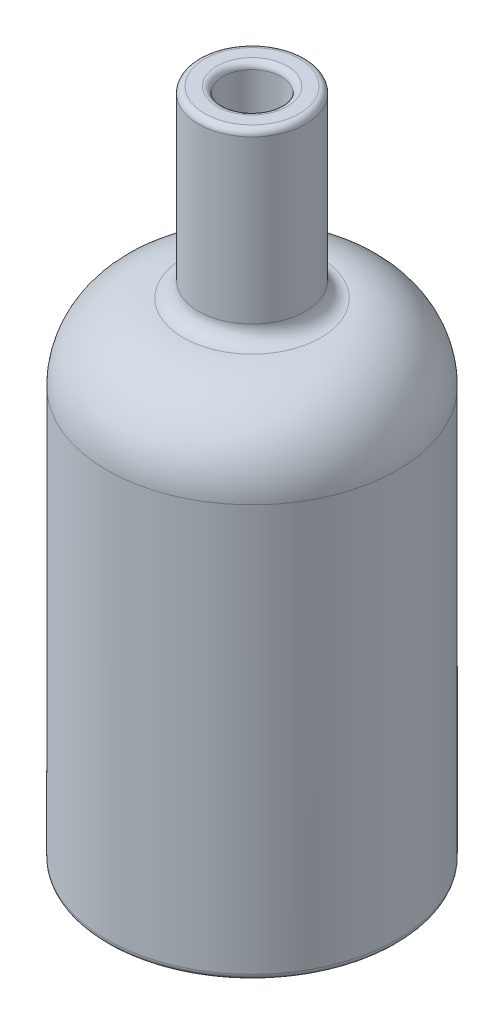
ISO-10303-21;
HEADER;
FILE_DESCRIPTION(('STEP AP214'),'2;1');
FILE_NAME('part.step','',(''),(''),'','','');
FILE_SCHEMA(('AUTOMOTIVE_DESIGN { 1 0 10303 214 1 1 1 1 }'));
ENDSEC;
DATA;
#1=APPLICATION_CONTEXT('core data for automotive mechanical design processes');
#2=APPLICATION_PROTOCOL_DEFINITION('international standard','automotive_design',2000,#1);
#3=PRODUCT_CONTEXT('',#1,'mechanical');
#4=PRODUCT('Part','Part','',(#3));
#5=PRODUCT_RELATED_PRODUCT_CATEGORY('part','',(#4));
#6=PRODUCT_DEFINITION_FORMATION('','',#4);
#7=PRODUCT_DEFINITION_CONTEXT('part definition',#1,'design');
#8=PRODUCT_DEFINITION('design','',#6,#7);
#9=PRODUCT_DEFINITION_SHAPE('','',#8);
#10=(LENGTH_UNIT() NAMED_UNIT(*) SI_UNIT(.MILLI.,.METRE.));
#11=(NAMED_UNIT(*) PLANE_ANGLE_UNIT() SI_UNIT($,.RADIAN.));
#12=(NAMED_UNIT(*) SI_UNIT($,.STERADIAN.) SOLID_ANGLE_UNIT());
#13=UNCERTAINTY_MEASURE_WITH_UNIT(LENGTH_MEASURE(1.E-05),#10,'distance_accuracy_value','');
#14=(GEOMETRIC_REPRESENTATION_CONTEXT(3) GLOBAL_UNCERTAINTY_ASSIGNED_CONTEXT((#13)) GLOBAL_UNIT_ASSIGNED_CONTEXT((#10,
#11,#12)) REPRESENTATION_CONTEXT('',''));
#15=CARTESIAN_POINT('',(0.,0.,0.));
#16=DIRECTION('',(0.,0.,1.));
#17=DIRECTION('',(1.,0.,0.));
#18=AXIS2_PLACEMENT_3D('',#15,#16,#17);
#19=CARTESIAN_POINT('',(0.,0.,0.));
#20=DIRECTION('',(0.,-1.,0.));
#21=DIRECTION('',(0.,0.,-1.));
#22=AXIS2_PLACEMENT_3D('',#19,#20,#21);
#23=PLANE('',#22);
#24=CARTESIAN_POINT('',(0.,0.,0.));
#25=DIRECTION('',(0.,-1.,0.));
#26=DIRECTION('',(0.,0.,-1.));
#27=AXIS2_PLACEMENT_3D('',#24,#25,#26);
#28=CIRCLE('',#27,45.5);
#29=CARTESIAN_POINT('',(0.,0.,-45.5));
#30=VERTEX_POINT('',#29);
#31=EDGE_CURVE('E60',#30,#30,#28,.T.);
#32=ORIENTED_EDGE('',*,*,#31,.T.);
#33=EDGE_LOOP('',(#32));
#34=FACE_BOUND('',#33,.T.);
#35=ADVANCED_FACE('F31',(#34),#23,.T.);
#36=CARTESIAN_POINT('',(0.,0.,0.));
#37=DIRECTION('',(0.,-1.,0.));
#38=DIRECTION('',(0.,0.,-1.));
#39=AXIS2_PLACEMENT_3D('',#36,#37,#38);
#40=CYLINDRICAL_SURFACE('',#39,47.5);
#41=CARTESIAN_POINT('',(0.,2.,0.));
#42=DIRECTION('',(0.,-1.,0.));
#43=DIRECTION('',(0.,0.,-1.));
#44=AXIS2_PLACEMENT_3D('',#41,#42,#43);
#45=CIRCLE('',#44,47.5);
#46=CARTESIAN_POINT('',(0.,2.,-47.5));
#47=VERTEX_POINT('',#46);
#48=EDGE_CURVE('E57',#47,#47,#45,.F.);
#49=ORIENTED_EDGE('',*,*,#48,.T.);
#50=EDGE_LOOP('',(#49));
#51=FACE_BOUND('',#50,.T.);
#52=CARTESIAN_POINT('',(0.,135.,0.));
#53=DIRECTION('',(0.,1.,0.));
#54=DIRECTION('',(0.,0.,1.));
#55=AXIS2_PLACEMENT_3D('',#52,#53,#54);
#56=CIRCLE('',#55,47.5);
#57=CARTESIAN_POINT('',(0.,135.,47.5));
#58=VERTEX_POINT('',#57);
#59=EDGE_CURVE('E75',#58,#58,#56,.F.);
#60=ORIENTED_EDGE('',*,*,#59,.T.);
#61=EDGE_LOOP('',(#60));
#62=FACE_BOUND('',#61,.T.);
#63=ADVANCED_FACE('F100',(#51,#62),#40,.T.);
#64=CARTESIAN_POINT('',(0.,0.,0.));
#65=DIRECTION('',(0.,-1.,0.));
#66=DIRECTION('',(0.,0.,-1.));
#67=AXIS2_PLACEMENT_3D('',#64,#65,#66);
#68=CYLINDRICAL_SURFACE('',#67,17.5);
#69=CARTESIAN_POINT('',(0.,218.,0.));
#70=DIRECTION('',(0.,1.,0.));
#71=DIRECTION('',(0.,0.,1.));
#72=AXIS2_PLACEMENT_3D('',#69,#70,#71);
#73=CIRCLE('',#72,17.5);
#74=CARTESIAN_POINT('',(0.,218.,17.5));
#75=VERTEX_POINT('',#74);
#76=EDGE_CURVE('E66',#75,#75,#73,.F.);
#77=ORIENTED_EDGE('',*,*,#76,.T.);
#78=EDGE_LOOP('',(#77));
#79=FACE_BOUND('',#78,.T.);
#80=CARTESIAN_POINT('',(0.,165.,0.));
#81=DIRECTION('',(0.,1.,0.));
#82=DIRECTION('',(0.,0.,1.));
#83=AXIS2_PLACEMENT_3D('',#80,#81,#82);
#84=CIRCLE('',#83,17.5);
#85=CARTESIAN_POINT('',(0.,165.,17.5));
#86=VERTEX_POINT('',#85);
#87=EDGE_CURVE('E69',#86,#86,#84,.T.);
#88=ORIENTED_EDGE('',*,*,#87,.T.);
#89=EDGE_LOOP('',(#88));
#90=FACE_BOUND('',#89,.T.);
#91=ADVANCED_FACE('F106',(#79,#90),#68,.T.);
#92=CARTESIAN_POINT('',(9.49999999999999,220.,0.));
#93=DIRECTION('',(0.,1.,0.));
#94=DIRECTION('',(0.,0.,1.));
#95=AXIS2_PLACEMENT_3D('',#92,#93,#94);
#96=PLANE('',#95);
#97=CARTESIAN_POINT('',(0.,220.,0.));
#98=DIRECTION('',(0.,1.,0.));
#99=DIRECTION('',(0.,0.,1.));
#100=AXIS2_PLACEMENT_3D('',#97,#98,#99);
#101=CIRCLE('',#100,11.5);
#102=CARTESIAN_POINT('',(0.,220.,11.5));
#103=VERTEX_POINT('',#102);
#104=EDGE_CURVE('E38',#103,#103,#101,.F.);
#105=ORIENTED_EDGE('',*,*,#104,.T.);
#106=EDGE_LOOP('',(#105));
#107=FACE_BOUND('',#106,.T.);
#108=CARTESIAN_POINT('',(0.,220.,0.));
#109=DIRECTION('',(0.,1.,0.));
#110=DIRECTION('',(0.,0.,1.));
#111=AXIS2_PLACEMENT_3D('',#108,#109,#110);
#112=CIRCLE('',#111,15.5);
#113=CARTESIAN_POINT('',(0.,220.,15.5));
#114=VERTEX_POINT('',#113);
#115=EDGE_CURVE('E63',#114,#114,#112,.T.);
#116=ORIENTED_EDGE('',*,*,#115,.T.);
#117=EDGE_LOOP('',(#116));
#118=FACE_BOUND('',#117,.T.);
#119=ADVANCED_FACE('F97',(#107,#118),#96,.T.);
#120=CARTESIAN_POINT('',(0.,0.,0.));
#121=DIRECTION('',(0.,-1.,0.));
#122=DIRECTION('',(0.,0.,-1.));
#123=AXIS2_PLACEMENT_3D('',#120,#121,#122);
#124=CYLINDRICAL_SURFACE('',#123,9.49999999999999);
#125=CARTESIAN_POINT('',(0.,218.,0.));
#126=DIRECTION('',(0.,1.,0.));
#127=DIRECTION('',(0.,0.,1.));
#128=AXIS2_PLACEMENT_3D('',#125,#126,#127);
#129=CIRCLE('',#128,9.49999999999999);
#130=CARTESIAN_POINT('',(0.,218.,9.49999999999999));
#131=VERTEX_POINT('',#130);
#132=EDGE_CURVE('E10',#131,#131,#129,.T.);
#133=ORIENTED_EDGE('',*,*,#132,.T.);
#134=EDGE_LOOP('',(#133));
#135=FACE_BOUND('',#134,.T.);
#136=CARTESIAN_POINT('',(0.,152.,0.));
#137=DIRECTION('',(0.,-1.,0.));
#138=DIRECTION('',(0.,0.,-1.));
#139=AXIS2_PLACEMENT_3D('',#136,#137,#138);
#140=CIRCLE('',#139,9.49999999999999);
#141=CARTESIAN_POINT('',(0.,152.,-9.49999999999999));
#142=VERTEX_POINT('',#141);
#143=EDGE_CURVE('E78',#142,#142,#140,.T.);
#144=ORIENTED_EDGE('',*,*,#143,.T.);
#145=EDGE_LOOP('',(#144));
#146=FACE_BOUND('',#145,.T.);
#147=ADVANCED_FACE('F82',(#135,#146),#124,.F.);
#148=CARTESIAN_POINT('',(39.5,152.,0.));
#149=DIRECTION('',(0.,-1.,0.));
#150=DIRECTION('',(0.,0.,-1.));
#151=AXIS2_PLACEMENT_3D('',#148,#149,#150);
#152=PLANE('',#151);
#153=CARTESIAN_POINT('',(0.,152.,0.));
#154=DIRECTION('',(0.,-1.,0.));
#155=DIRECTION('',(0.,0.,-1.));
#156=AXIS2_PLACEMENT_3D('',#153,#154,#155);
#157=CIRCLE('',#156,22.5);
#158=CARTESIAN_POINT('',(0.,152.,-22.5));
#159=VERTEX_POINT('',#158);
#160=EDGE_CURVE('E54',#159,#159,#157,.T.);
#161=ORIENTED_EDGE('',*,*,#160,.T.);
#162=EDGE_LOOP('',(#161));
#163=FACE_BOUND('',#162,.T.);
#164=ORIENTED_EDGE('',*,*,#143,.F.);
#165=EDGE_LOOP('',(#164));
#166=FACE_BOUND('',#165,.T.);
#167=ADVANCED_FACE('F84',(#163,#166),#152,.T.);
#168=CARTESIAN_POINT('',(0.,0.,0.));
#169=DIRECTION('',(0.,-1.,0.));
#170=DIRECTION('',(0.,0.,-1.));
#171=AXIS2_PLACEMENT_3D('',#168,#169,#170);
#172=CYLINDRICAL_SURFACE('',#171,39.5);
#173=CARTESIAN_POINT('',(0.,10.,0.));
#174=DIRECTION('',(0.,1.,0.));
#175=DIRECTION('',(0.,0.,1.));
#176=AXIS2_PLACEMENT_3D('',#173,#174,#175);
#177=CIRCLE('',#176,39.5);
#178=CARTESIAN_POINT('',(0.,10.,39.5));
#179=VERTEX_POINT('',#178);
#180=EDGE_CURVE('E46',#179,#179,#177,.F.);
#181=ORIENTED_EDGE('',*,*,#180,.T.);
#182=EDGE_LOOP('',(#181));
#183=FACE_BOUND('',#182,.T.);
#184=CARTESIAN_POINT('',(0.,135.,0.));
#185=DIRECTION('',(0.,-1.,0.));
#186=DIRECTION('',(0.,0.,-1.));
#187=AXIS2_PLACEMENT_3D('',#184,#185,#186);
#188=CIRCLE('',#187,39.5);
#189=CARTESIAN_POINT('',(0.,135.,-39.5));
#190=VERTEX_POINT('',#189);
#191=EDGE_CURVE('E51',#190,#190,#188,.F.);
#192=ORIENTED_EDGE('',*,*,#191,.T.);
#193=EDGE_LOOP('',(#192));
#194=FACE_BOUND('',#193,.T.);
#195=ADVANCED_FACE('F86',(#183,#194),#172,.F.);
#196=CARTESIAN_POINT('',(0.,8.,0.));
#197=DIRECTION('',(0.,1.,0.));
#198=DIRECTION('',(0.,0.,1.));
#199=AXIS2_PLACEMENT_3D('',#196,#197,#198);
#200=PLANE('',#199);
#201=CARTESIAN_POINT('',(0.,8.,0.));
#202=DIRECTION('',(0.,1.,0.));
#203=DIRECTION('',(0.,0.,1.));
#204=AXIS2_PLACEMENT_3D('',#201,#202,#203);
#205=CIRCLE('',#204,37.5);
#206=CARTESIAN_POINT('',(0.,8.,37.5));
#207=VERTEX_POINT('',#206);
#208=EDGE_CURVE('E42',#207,#207,#205,.T.);
#209=ORIENTED_EDGE('',*,*,#208,.T.);
#210=EDGE_LOOP('',(#209));
#211=FACE_BOUND('',#210,.T.);
#212=ADVANCED_FACE('F93',(#211),#200,.T.);
#213=CARTESIAN_POINT('',(0.,135.,0.));
#214=DIRECTION('',(0.,1.,0.));
#215=DIRECTION('',(0.,0.,1.));
#216=AXIS2_PLACEMENT_3D('',#213,#214,#215);
#217=DEGENERATE_TOROIDAL_SURFACE('',#216,22.5,25.,.T.);
#218=CARTESIAN_POINT('',(0.,160.,0.));
#219=DIRECTION('',(0.,1.,0.));
#220=DIRECTION('',(0.,0.,1.));
#221=AXIS2_PLACEMENT_3D('',#218,#219,#220);
#222=CIRCLE('',#221,22.5);
#223=CARTESIAN_POINT('',(0.,160.,22.5));
#224=VERTEX_POINT('',#223);
#225=EDGE_CURVE('E72',#224,#224,#222,.T.);
#226=ORIENTED_EDGE('',*,*,#225,.F.);
#227=EDGE_LOOP('',(#226));
#228=FACE_BOUND('',#227,.T.);
#229=ORIENTED_EDGE('',*,*,#59,.F.);
#230=EDGE_LOOP('',(#229));
#231=FACE_BOUND('',#230,.T.);
#232=ADVANCED_FACE('F111',(#228,#231),#217,.T.);
#233=CARTESIAN_POINT('',(0.,165.,0.));
#234=DIRECTION('',(0.,1.,0.));
#235=DIRECTION('',(0.,0.,1.));
#236=AXIS2_PLACEMENT_3D('',#233,#234,#235);
#237=TOROIDAL_SURFACE('',#236,22.5,5.);
#238=ORIENTED_EDGE('',*,*,#87,.F.);
#239=EDGE_LOOP('',(#238));
#240=FACE_BOUND('',#239,.T.);
#241=ORIENTED_EDGE('',*,*,#225,.T.);
#242=EDGE_LOOP('',(#241));
#243=FACE_BOUND('',#242,.T.);
#244=ADVANCED_FACE('F114',(#240,#243),#237,.F.);
#245=CARTESIAN_POINT('',(0.,218.,0.));
#246=DIRECTION('',(0.,1.,0.));
#247=DIRECTION('',(0.,0.,1.));
#248=AXIS2_PLACEMENT_3D('',#245,#246,#247);
#249=TOROIDAL_SURFACE('',#248,15.5,2.);
#250=ORIENTED_EDGE('',*,*,#115,.F.);
#251=EDGE_LOOP('',(#250));
#252=FACE_BOUND('',#251,.T.);
#253=ORIENTED_EDGE('',*,*,#76,.F.);
#254=EDGE_LOOP('',(#253));
#255=FACE_BOUND('',#254,.T.);
#256=ADVANCED_FACE('F118',(#252,#255),#249,.T.);
#257=CARTESIAN_POINT('',(0.,2.,0.));
#258=DIRECTION('',(0.,-1.,0.));
#259=DIRECTION('',(0.,0.,-1.));
#260=AXIS2_PLACEMENT_3D('',#257,#258,#259);
#261=TOROIDAL_SURFACE('',#260,45.5,2.);
#262=ORIENTED_EDGE('',*,*,#48,.F.);
#263=EDGE_LOOP('',(#262));
#264=FACE_BOUND('',#263,.T.);
#265=ORIENTED_EDGE('',*,*,#31,.F.);
#266=EDGE_LOOP('',(#265));
#267=FACE_BOUND('',#266,.T.);
#268=ADVANCED_FACE('F122',(#264,#267),#261,.T.);
#269=CARTESIAN_POINT('',(0.,135.,0.));
#270=DIRECTION('',(0.,-1.,0.));
#271=DIRECTION('',(0.,0.,-1.));
#272=AXIS2_PLACEMENT_3D('',#269,#270,#271);
#273=TOROIDAL_SURFACE('',#272,22.5,17.);
#274=ORIENTED_EDGE('',*,*,#191,.F.);
#275=EDGE_LOOP('',(#274));
#276=FACE_BOUND('',#275,.T.);
#277=ORIENTED_EDGE('',*,*,#160,.F.);
#278=EDGE_LOOP('',(#277));
#279=FACE_BOUND('',#278,.T.);
#280=ADVANCED_FACE('F126',(#276,#279),#273,.F.);
#281=CARTESIAN_POINT('',(0.,10.,0.));
#282=DIRECTION('',(0.,1.,0.));
#283=DIRECTION('',(0.,0.,1.));
#284=AXIS2_PLACEMENT_3D('',#281,#282,#283);
#285=TOROIDAL_SURFACE('',#284,37.5,2.);
#286=ORIENTED_EDGE('',*,*,#208,.F.);
#287=EDGE_LOOP('',(#286));
#288=FACE_BOUND('',#287,.T.);
#289=ORIENTED_EDGE('',*,*,#180,.F.);
#290=EDGE_LOOP('',(#289));
#291=FACE_BOUND('',#290,.T.);
#292=ADVANCED_FACE('F129',(#288,#291),#285,.F.);
#293=CARTESIAN_POINT('',(0.,218.,0.));
#294=DIRECTION('',(0.,1.,0.));
#295=DIRECTION('',(0.,0.,1.));
#296=AXIS2_PLACEMENT_3D('',#293,#294,#295);
#297=TOROIDAL_SURFACE('',#296,11.5,2.);
#298=ORIENTED_EDGE('',*,*,#132,.F.);
#299=EDGE_LOOP('',(#298));
#300=FACE_BOUND('',#299,.T.);
#301=ORIENTED_EDGE('',*,*,#104,.F.);
#302=EDGE_LOOP('',(#301));
#303=FACE_BOUND('',#302,.T.);
#304=ADVANCED_FACE('F33',(#300,#303),#297,.T.);
#305=CLOSED_SHELL('',(#35,#63,#91,#119,#147,#167,#195,#212,#232,#244,#256,#268,#280,#292,#304));
#306=MANIFOLD_SOLID_BREP('B2',#305);
#307=ADVANCED_BREP_SHAPE_REPRESENTATION('',(#18,#306),#14);
#308=SHAPE_DEFINITION_REPRESENTATION(#9,#307);
ENDSEC;
END-ISO-10303-21;
